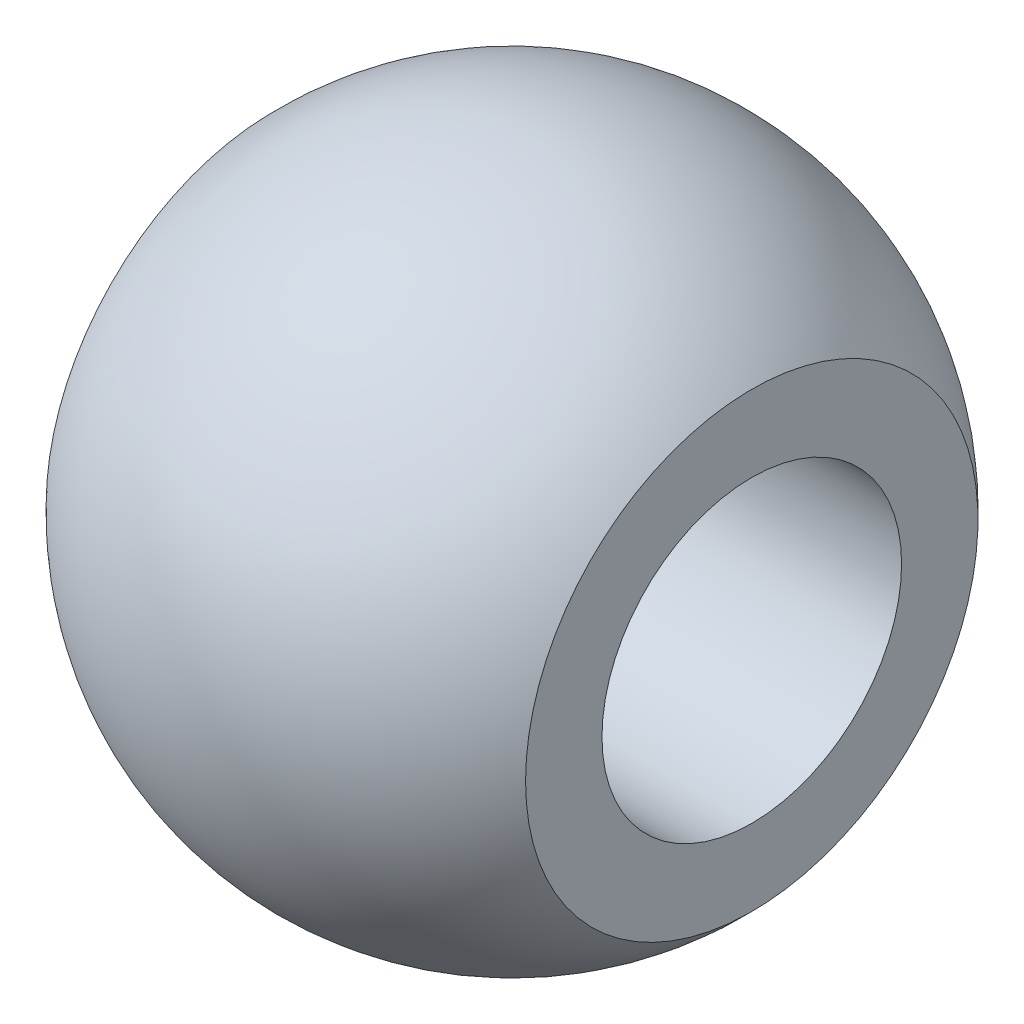
ISO-10303-21;
HEADER;
FILE_DESCRIPTION(('STEP AP214'),'2;1');
FILE_NAME('part.step','',(''),(''),'','','');
FILE_SCHEMA(('AUTOMOTIVE_DESIGN { 1 0 10303 214 1 1 1 1 }'));
ENDSEC;
DATA;
#1=APPLICATION_CONTEXT('core data for automotive mechanical design processes');
#2=APPLICATION_PROTOCOL_DEFINITION('international standard','automotive_design',2000,#1);
#3=PRODUCT_CONTEXT('',#1,'mechanical');
#4=PRODUCT('Part','Part','',(#3));
#5=PRODUCT_RELATED_PRODUCT_CATEGORY('part','',(#4));
#6=PRODUCT_DEFINITION_FORMATION('','',#4);
#7=PRODUCT_DEFINITION_CONTEXT('part definition',#1,'design');
#8=PRODUCT_DEFINITION('design','',#6,#7);
#9=PRODUCT_DEFINITION_SHAPE('','',#8);
#10=(LENGTH_UNIT() NAMED_UNIT(*) SI_UNIT(.MILLI.,.METRE.));
#11=(NAMED_UNIT(*) PLANE_ANGLE_UNIT() SI_UNIT($,.RADIAN.));
#12=(NAMED_UNIT(*) SI_UNIT($,.STERADIAN.) SOLID_ANGLE_UNIT());
#13=UNCERTAINTY_MEASURE_WITH_UNIT(LENGTH_MEASURE(1.E-05),#10,'distance_accuracy_value','');
#14=(GEOMETRIC_REPRESENTATION_CONTEXT(3) GLOBAL_UNCERTAINTY_ASSIGNED_CONTEXT((#13)) GLOBAL_UNIT_ASSIGNED_CONTEXT((#10,
#11,#12)) REPRESENTATION_CONTEXT('',''));
#15=CARTESIAN_POINT('',(0.,0.,0.));
#16=DIRECTION('',(0.,0.,1.));
#17=DIRECTION('',(1.,0.,0.));
#18=AXIS2_PLACEMENT_3D('',#15,#16,#17);
#19=CARTESIAN_POINT('',(0.,0.,0.));
#20=DIRECTION('',(-1.,0.,0.));
#21=DIRECTION('',(0.,1.,0.));
#22=AXIS2_PLACEMENT_3D('',#19,#20,#21);
#23=SPHERICAL_SURFACE('',#22,5.5);
#24=CARTESIAN_POINT('',(-4.,0.,0.));
#25=DIRECTION('',(-1.,0.,0.));
#26=DIRECTION('',(0.,0.,1.));
#27=AXIS2_PLACEMENT_3D('',#24,#25,#26);
#28=CIRCLE('',#27,3.77491721763537);
#29=CARTESIAN_POINT('',(-4.,0.,3.77491721763537));
#30=VERTEX_POINT('',#29);
#31=EDGE_CURVE('E46',#30,#30,#28,.T.);
#32=ORIENTED_EDGE('',*,*,#31,.F.);
#33=EDGE_LOOP('',(#32));
#34=FACE_BOUND('',#33,.T.);
#35=CARTESIAN_POINT('',(4.,0.,0.));
#36=DIRECTION('',(-1.,0.,0.));
#37=DIRECTION('',(0.,0.,1.));
#38=AXIS2_PLACEMENT_3D('',#35,#36,#37);
#39=CIRCLE('',#38,3.77491721763537);
#40=CARTESIAN_POINT('',(4.,0.,3.77491721763537));
#41=VERTEX_POINT('',#40);
#42=EDGE_CURVE('E10',#41,#41,#39,.T.);
#43=ORIENTED_EDGE('',*,*,#42,.T.);
#44=EDGE_LOOP('',(#43));
#45=FACE_BOUND('',#44,.T.);
#46=ADVANCED_FACE('F32',(#34,#45),#23,.T.);
#47=CARTESIAN_POINT('',(4.,3.77491721763537,0.));
#48=DIRECTION('',(-1.,0.,0.));
#49=DIRECTION('',(0.,0.,1.));
#50=AXIS2_PLACEMENT_3D('',#47,#48,#49);
#51=PLANE('',#50);
#52=ORIENTED_EDGE('',*,*,#42,.F.);
#53=EDGE_LOOP('',(#52));
#54=FACE_BOUND('',#53,.T.);
#55=CARTESIAN_POINT('',(4.,0.,0.));
#56=DIRECTION('',(-1.,0.,0.));
#57=DIRECTION('',(0.,0.,1.));
#58=AXIS2_PLACEMENT_3D('',#55,#56,#57);
#59=CIRCLE('',#58,2.5);
#60=CARTESIAN_POINT('',(4.,0.,2.5));
#61=VERTEX_POINT('',#60);
#62=EDGE_CURVE('E38',#61,#61,#59,.T.);
#63=ORIENTED_EDGE('',*,*,#62,.T.);
#64=EDGE_LOOP('',(#63));
#65=FACE_BOUND('',#64,.T.);
#66=ADVANCED_FACE('F55',(#54,#65),#51,.F.);
#67=CARTESIAN_POINT('',(-6.07712765957447,0.,0.));
#68=DIRECTION('',(-1.,0.,0.));
#69=DIRECTION('',(0.,0.,1.));
#70=AXIS2_PLACEMENT_3D('',#67,#68,#69);
#71=CYLINDRICAL_SURFACE('',#70,2.5);
#72=ORIENTED_EDGE('',*,*,#62,.F.);
#73=EDGE_LOOP('',(#72));
#74=FACE_BOUND('',#73,.T.);
#75=CARTESIAN_POINT('',(-4.,0.,0.));
#76=DIRECTION('',(-1.,0.,0.));
#77=DIRECTION('',(0.,0.,1.));
#78=AXIS2_PLACEMENT_3D('',#75,#76,#77);
#79=CIRCLE('',#78,2.5);
#80=CARTESIAN_POINT('',(-4.,0.,2.5));
#81=VERTEX_POINT('',#80);
#82=EDGE_CURVE('E42',#81,#81,#79,.T.);
#83=ORIENTED_EDGE('',*,*,#82,.T.);
#84=EDGE_LOOP('',(#83));
#85=FACE_BOUND('',#84,.T.);
#86=ADVANCED_FACE('F59',(#74,#85),#71,.F.);
#87=CARTESIAN_POINT('',(-4.,3.77491721763537,0.));
#88=DIRECTION('',(1.,0.,0.));
#89=DIRECTION('',(0.,0.,-1.));
#90=AXIS2_PLACEMENT_3D('',#87,#88,#89);
#91=PLANE('',#90);
#92=ORIENTED_EDGE('',*,*,#82,.F.);
#93=EDGE_LOOP('',(#92));
#94=FACE_BOUND('',#93,.T.);
#95=ORIENTED_EDGE('',*,*,#31,.T.);
#96=EDGE_LOOP('',(#95));
#97=FACE_BOUND('',#96,.T.);
#98=ADVANCED_FACE('F52',(#94,#97),#91,.F.);
#99=CLOSED_SHELL('',(#46,#66,#86,#98));
#100=MANIFOLD_SOLID_BREP('B2',#99);
#101=ADVANCED_BREP_SHAPE_REPRESENTATION('',(#18,#100),#14);
#102=SHAPE_DEFINITION_REPRESENTATION(#9,#101);
ENDSEC;
END-ISO-10303-21;
